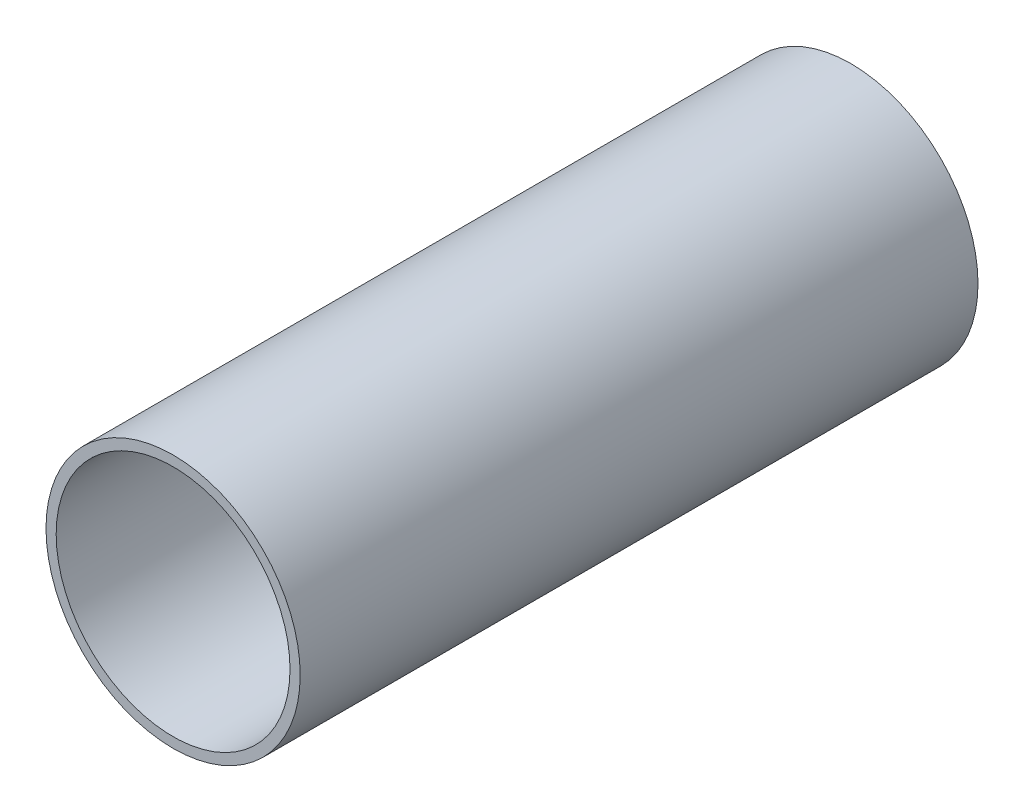
ISO-10303-21;
HEADER;
FILE_DESCRIPTION(('STEP AP214'),'2;1');
FILE_NAME('part.step','',(''),(''),'','','');
FILE_SCHEMA(('AUTOMOTIVE_DESIGN { 1 0 10303 214 1 1 1 1 }'));
ENDSEC;
DATA;
#1=APPLICATION_CONTEXT('core data for automotive mechanical design processes');
#2=APPLICATION_PROTOCOL_DEFINITION('international standard','automotive_design',2000,#1);
#3=PRODUCT_CONTEXT('',#1,'mechanical');
#4=PRODUCT('Part','Part','',(#3));
#5=PRODUCT_RELATED_PRODUCT_CATEGORY('part','',(#4));
#6=PRODUCT_DEFINITION_FORMATION('','',#4);
#7=PRODUCT_DEFINITION_CONTEXT('part definition',#1,'design');
#8=PRODUCT_DEFINITION('design','',#6,#7);
#9=PRODUCT_DEFINITION_SHAPE('','',#8);
#10=(LENGTH_UNIT() NAMED_UNIT(*) SI_UNIT(.MILLI.,.METRE.));
#11=(NAMED_UNIT(*) PLANE_ANGLE_UNIT() SI_UNIT($,.RADIAN.));
#12=(NAMED_UNIT(*) SI_UNIT($,.STERADIAN.) SOLID_ANGLE_UNIT());
#13=UNCERTAINTY_MEASURE_WITH_UNIT(LENGTH_MEASURE(1.E-05),#10,'distance_accuracy_value','');
#14=(GEOMETRIC_REPRESENTATION_CONTEXT(3) GLOBAL_UNCERTAINTY_ASSIGNED_CONTEXT((#13)) GLOBAL_UNIT_ASSIGNED_CONTEXT((#10,
#11,#12)) REPRESENTATION_CONTEXT('',''));
#15=CARTESIAN_POINT('',(0.,0.,0.));
#16=DIRECTION('',(0.,0.,1.));
#17=DIRECTION('',(1.,0.,0.));
#18=AXIS2_PLACEMENT_3D('',#15,#16,#17);
#19=CARTESIAN_POINT('',(0.,0.,200.));
#20=DIRECTION('',(0.,0.,1.));
#21=DIRECTION('',(1.,0.,0.));
#22=AXIS2_PLACEMENT_3D('',#19,#20,#21);
#23=PLANE('',#22);
#24=CARTESIAN_POINT('',(0.,0.,200.));
#25=DIRECTION('',(0.,0.,1.));
#26=DIRECTION('',(1.,0.,0.));
#27=AXIS2_PLACEMENT_3D('',#24,#25,#26);
#28=CIRCLE('',#27,37.5);
#29=CARTESIAN_POINT('',(37.5,0.,200.));
#30=VERTEX_POINT('',#29);
#31=EDGE_CURVE('E11',#30,#30,#28,.T.);
#32=ORIENTED_EDGE('',*,*,#31,.T.);
#33=EDGE_LOOP('',(#32));
#34=FACE_BOUND('',#33,.T.);
#35=CARTESIAN_POINT('',(0.,0.,200.));
#36=DIRECTION('',(0.,0.,1.));
#37=DIRECTION('',(1.,0.,0.));
#38=AXIS2_PLACEMENT_3D('',#35,#36,#37);
#39=CIRCLE('',#38,34.5);
#40=CARTESIAN_POINT('',(34.5,0.,200.));
#41=VERTEX_POINT('',#40);
#42=EDGE_CURVE('E56',#41,#41,#39,.T.);
#43=ORIENTED_EDGE('',*,*,#42,.F.);
#44=EDGE_LOOP('',(#43));
#45=FACE_BOUND('',#44,.T.);
#46=ADVANCED_FACE('F43',(#34,#45),#23,.T.);
#47=CARTESIAN_POINT('',(0.,0.,0.));
#48=DIRECTION('',(0.,0.,1.));
#49=DIRECTION('',(1.,0.,0.));
#50=AXIS2_PLACEMENT_3D('',#47,#48,#49);
#51=PLANE('',#50);
#52=CARTESIAN_POINT('',(0.,0.,0.));
#53=DIRECTION('',(0.,0.,1.));
#54=DIRECTION('',(1.,0.,0.));
#55=AXIS2_PLACEMENT_3D('',#52,#53,#54);
#56=CIRCLE('',#55,37.5);
#57=CARTESIAN_POINT('',(37.5,0.,0.));
#58=VERTEX_POINT('',#57);
#59=EDGE_CURVE('E47',#58,#58,#56,.T.);
#60=ORIENTED_EDGE('',*,*,#59,.F.);
#61=EDGE_LOOP('',(#60));
#62=FACE_BOUND('',#61,.T.);
#63=CARTESIAN_POINT('',(0.,0.,0.));
#64=DIRECTION('',(0.,0.,1.));
#65=DIRECTION('',(1.,0.,0.));
#66=AXIS2_PLACEMENT_3D('',#63,#64,#65);
#67=CIRCLE('',#66,34.5);
#68=CARTESIAN_POINT('',(34.5,0.,0.));
#69=VERTEX_POINT('',#68);
#70=EDGE_CURVE('E58',#69,#69,#67,.T.);
#71=ORIENTED_EDGE('',*,*,#70,.T.);
#72=EDGE_LOOP('',(#71));
#73=FACE_BOUND('',#72,.T.);
#74=ADVANCED_FACE('F70',(#62,#73),#51,.F.);
#75=CARTESIAN_POINT('',(0.,0.,200.));
#76=DIRECTION('',(0.,0.,-1.));
#77=DIRECTION('',(-1.,0.,0.));
#78=AXIS2_PLACEMENT_3D('',#75,#76,#77);
#79=CYLINDRICAL_SURFACE('',#78,37.5);
#80=ORIENTED_EDGE('',*,*,#31,.F.);
#81=EDGE_LOOP('',(#80));
#82=FACE_BOUND('',#81,.T.);
#83=ORIENTED_EDGE('',*,*,#59,.T.);
#84=EDGE_LOOP('',(#83));
#85=FACE_BOUND('',#84,.T.);
#86=ADVANCED_FACE('F45',(#82,#85),#79,.T.);
#87=CARTESIAN_POINT('',(0.,0.,200.));
#88=DIRECTION('',(0.,0.,-1.));
#89=DIRECTION('',(-1.,0.,0.));
#90=AXIS2_PLACEMENT_3D('',#87,#88,#89);
#91=CYLINDRICAL_SURFACE('',#90,34.5);
#92=ORIENTED_EDGE('',*,*,#42,.T.);
#93=EDGE_LOOP('',(#92));
#94=FACE_BOUND('',#93,.T.);
#95=ORIENTED_EDGE('',*,*,#70,.F.);
#96=EDGE_LOOP('',(#95));
#97=FACE_BOUND('',#96,.T.);
#98=ADVANCED_FACE('F66',(#94,#97),#91,.F.);
#99=CLOSED_SHELL('',(#46,#74,#86,#98));
#100=MANIFOLD_SOLID_BREP('B2',#99);
#101=ADVANCED_BREP_SHAPE_REPRESENTATION('',(#18,#100),#14);
#102=SHAPE_DEFINITION_REPRESENTATION(#9,#101);
ENDSEC;
END-ISO-10303-21;
